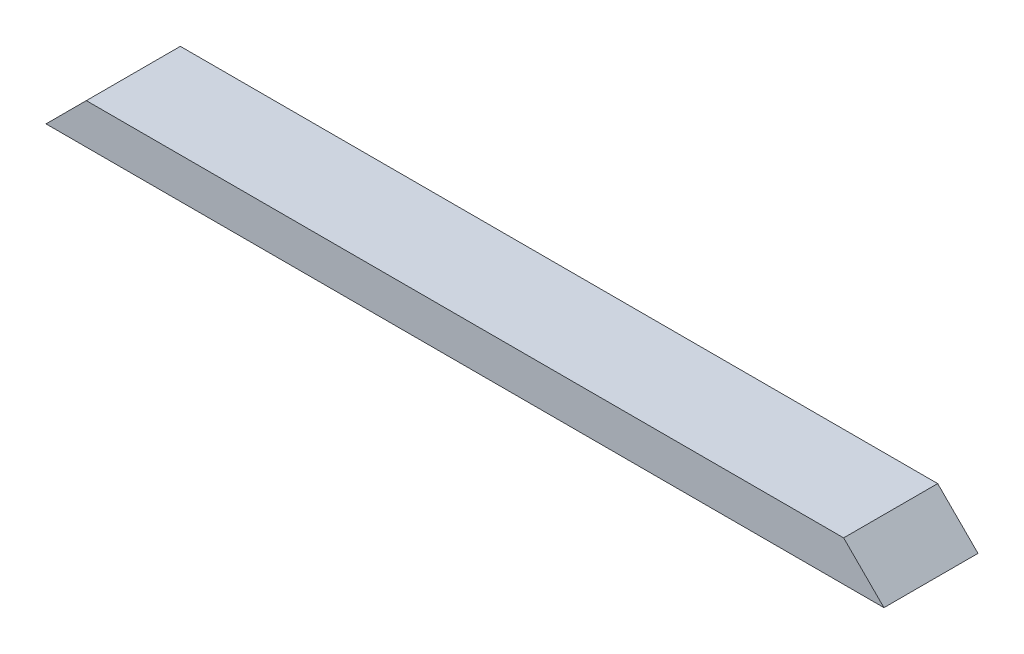
ISO-10303-21;
HEADER;
FILE_DESCRIPTION(('STEP AP214'),'2;1');
FILE_NAME('part.step','',(''),(''),'','','');
FILE_SCHEMA(('AUTOMOTIVE_DESIGN { 1 0 10303 214 1 1 1 1 }'));
ENDSEC;
DATA;
#1=APPLICATION_CONTEXT('core data for automotive mechanical design processes');
#2=APPLICATION_PROTOCOL_DEFINITION('international standard','automotive_design',2000,#1);
#3=PRODUCT_CONTEXT('',#1,'mechanical');
#4=PRODUCT('Part','Part','',(#3));
#5=PRODUCT_RELATED_PRODUCT_CATEGORY('part','',(#4));
#6=PRODUCT_DEFINITION_FORMATION('','',#4);
#7=PRODUCT_DEFINITION_CONTEXT('part definition',#1,'design');
#8=PRODUCT_DEFINITION('design','',#6,#7);
#9=PRODUCT_DEFINITION_SHAPE('','',#8);
#10=(LENGTH_UNIT() NAMED_UNIT(*) SI_UNIT(.MILLI.,.METRE.));
#11=(NAMED_UNIT(*) PLANE_ANGLE_UNIT() SI_UNIT($,.RADIAN.));
#12=(NAMED_UNIT(*) SI_UNIT($,.STERADIAN.) SOLID_ANGLE_UNIT());
#13=UNCERTAINTY_MEASURE_WITH_UNIT(LENGTH_MEASURE(1.E-05),#10,'distance_accuracy_value','');
#14=(GEOMETRIC_REPRESENTATION_CONTEXT(3) GLOBAL_UNCERTAINTY_ASSIGNED_CONTEXT((#13)) GLOBAL_UNIT_ASSIGNED_CONTEXT((#10,
#11,#12)) REPRESENTATION_CONTEXT('',''));
#15=CARTESIAN_POINT('',(0.,0.,0.));
#16=DIRECTION('',(0.,0.,1.));
#17=DIRECTION('',(1.,0.,0.));
#18=AXIS2_PLACEMENT_3D('',#15,#16,#17);
#19=CARTESIAN_POINT('',(0.,38.1,0.));
#20=DIRECTION('',(0.,0.,-1.));
#21=DIRECTION('',(-1.,0.,0.));
#22=AXIS2_PLACEMENT_3D('',#19,#20,#21);
#23=PLANE('',#22);
#24=DIRECTION('',(1.,0.,0.));
#25=VECTOR('',#24,1.);
#26=CARTESIAN_POINT('',(0.,38.1,0.));
#27=LINE('',#26,#25);
#28=CARTESIAN_POINT('',(38.1,38.1,0.));
#29=VERTEX_POINT('',#28);
#30=CARTESIAN_POINT('',(754.0752,38.1,0.));
#31=VERTEX_POINT('',#30);
#32=EDGE_CURVE('E47',#29,#31,#27,.T.);
#33=ORIENTED_EDGE('',*,*,#32,.F.);
#34=DIRECTION('',(0.707106781186547,0.707106781186547,0.));
#35=VECTOR('',#34,1.);
#36=CARTESIAN_POINT('',(0.,0.,0.));
#37=LINE('',#36,#35);
#38=CARTESIAN_POINT('',(0.,0.,0.));
#39=VERTEX_POINT('',#38);
#40=EDGE_CURVE('E82',#39,#29,#37,.T.);
#41=ORIENTED_EDGE('',*,*,#40,.F.);
#42=DIRECTION('',(1.,0.,0.));
#43=VECTOR('',#42,1.);
#44=CARTESIAN_POINT('',(0.,0.,0.));
#45=LINE('',#44,#43);
#46=CARTESIAN_POINT('',(792.1752,0.,0.));
#47=VERTEX_POINT('',#46);
#48=EDGE_CURVE('E87',#39,#47,#45,.T.);
#49=ORIENTED_EDGE('',*,*,#48,.T.);
#50=DIRECTION('',(0.707106781186548,-0.707106781186547,0.));
#51=VECTOR('',#50,1.);
#52=CARTESIAN_POINT('',(754.0752,38.1,0.));
#53=LINE('',#52,#51);
#54=EDGE_CURVE('E63',#31,#47,#53,.T.);
#55=ORIENTED_EDGE('',*,*,#54,.F.);
#56=EDGE_LOOP('',(#33,#41,#49,#55));
#57=FACE_BOUND('',#56,.T.);
#58=ADVANCED_FACE('F39',(#57),#23,.F.);
#59=CARTESIAN_POINT('',(0.,38.1,-88.9));
#60=DIRECTION('',(0.,0.,1.));
#61=DIRECTION('',(1.,0.,0.));
#62=AXIS2_PLACEMENT_3D('',#59,#60,#61);
#63=PLANE('',#62);
#64=DIRECTION('',(-1.,0.,0.));
#65=VECTOR('',#64,1.);
#66=CARTESIAN_POINT('',(0.,0.,-88.9));
#67=LINE('',#66,#65);
#68=CARTESIAN_POINT('',(792.1752,0.,-88.9));
#69=VERTEX_POINT('',#68);
#70=CARTESIAN_POINT('',(0.,0.,-88.9));
#71=VERTEX_POINT('',#70);
#72=EDGE_CURVE('E42',#69,#71,#67,.T.);
#73=ORIENTED_EDGE('',*,*,#72,.T.);
#74=DIRECTION('',(0.707106781186547,0.707106781186547,0.));
#75=VECTOR('',#74,1.);
#76=CARTESIAN_POINT('',(0.,0.,-88.9));
#77=LINE('',#76,#75);
#78=CARTESIAN_POINT('',(38.1,38.1,-88.9));
#79=VERTEX_POINT('',#78);
#80=EDGE_CURVE('E55',#71,#79,#77,.T.);
#81=ORIENTED_EDGE('',*,*,#80,.T.);
#82=DIRECTION('',(-1.,0.,0.));
#83=VECTOR('',#82,1.);
#84=CARTESIAN_POINT('',(0.,38.1,-88.9));
#85=LINE('',#84,#83);
#86=CARTESIAN_POINT('',(754.0752,38.1,-88.9));
#87=VERTEX_POINT('',#86);
#88=EDGE_CURVE('E11',#87,#79,#85,.T.);
#89=ORIENTED_EDGE('',*,*,#88,.F.);
#90=DIRECTION('',(0.707106781186548,-0.707106781186547,0.));
#91=VECTOR('',#90,1.);
#92=CARTESIAN_POINT('',(754.0752,38.1,-88.9));
#93=LINE('',#92,#91);
#94=EDGE_CURVE('E100',#87,#69,#93,.T.);
#95=ORIENTED_EDGE('',*,*,#94,.T.);
#96=EDGE_LOOP('',(#73,#81,#89,#95));
#97=FACE_BOUND('',#96,.T.);
#98=ADVANCED_FACE('F109',(#97),#63,.F.);
#99=CARTESIAN_POINT('',(0.,38.1,0.));
#100=DIRECTION('',(0.,-1.,0.));
#101=DIRECTION('',(0.,0.,-1.));
#102=AXIS2_PLACEMENT_3D('',#99,#100,#101);
#103=PLANE('',#102);
#104=ORIENTED_EDGE('',*,*,#88,.T.);
#105=DIRECTION('',(0.,0.,1.));
#106=VECTOR('',#105,1.);
#107=CARTESIAN_POINT('',(38.1,38.1,-88.9));
#108=LINE('',#107,#106);
#109=EDGE_CURVE('E88',#79,#29,#108,.T.);
#110=ORIENTED_EDGE('',*,*,#109,.T.);
#111=ORIENTED_EDGE('',*,*,#32,.T.);
#112=DIRECTION('',(0.,0.,1.));
#113=VECTOR('',#112,1.);
#114=CARTESIAN_POINT('',(754.0752,38.1,-88.9));
#115=LINE('',#114,#113);
#116=EDGE_CURVE('E103',#87,#31,#115,.T.);
#117=ORIENTED_EDGE('',*,*,#116,.F.);
#118=EDGE_LOOP('',(#104,#110,#111,#117));
#119=FACE_BOUND('',#118,.T.);
#120=ADVANCED_FACE('F112',(#119),#103,.F.);
#121=CARTESIAN_POINT('',(0.,0.,0.));
#122=DIRECTION('',(0.,-1.,0.));
#123=DIRECTION('',(0.,0.,-1.));
#124=AXIS2_PLACEMENT_3D('',#121,#122,#123);
#125=PLANE('',#124);
#126=DIRECTION('',(0.,0.,1.));
#127=VECTOR('',#126,1.);
#128=CARTESIAN_POINT('',(0.,0.,0.));
#129=LINE('',#128,#127);
#130=EDGE_CURVE('E79',#71,#39,#129,.T.);
#131=ORIENTED_EDGE('',*,*,#130,.F.);
#132=ORIENTED_EDGE('',*,*,#72,.F.);
#133=DIRECTION('',(0.,0.,-1.));
#134=VECTOR('',#133,1.);
#135=CARTESIAN_POINT('',(792.1752,0.,0.));
#136=LINE('',#135,#134);
#137=EDGE_CURVE('E96',#47,#69,#136,.T.);
#138=ORIENTED_EDGE('',*,*,#137,.F.);
#139=ORIENTED_EDGE('',*,*,#48,.F.);
#140=EDGE_LOOP('',(#131,#132,#138,#139));
#141=FACE_BOUND('',#140,.T.);
#142=ADVANCED_FACE('F95',(#141),#125,.T.);
#143=CARTESIAN_POINT('',(754.0752,38.1,-88.9));
#144=DIRECTION('',(-0.707106781186547,-0.707106781186548,0.));
#145=DIRECTION('',(0.707106781186548,-0.707106781186547,0.));
#146=AXIS2_PLACEMENT_3D('',#143,#144,#145);
#147=PLANE('',#146);
#148=ORIENTED_EDGE('',*,*,#54,.T.);
#149=ORIENTED_EDGE('',*,*,#137,.T.);
#150=ORIENTED_EDGE('',*,*,#94,.F.);
#151=ORIENTED_EDGE('',*,*,#116,.T.);
#152=EDGE_LOOP('',(#148,#149,#150,#151));
#153=FACE_BOUND('',#152,.T.);
#154=ADVANCED_FACE('F113',(#153),#147,.F.);
#155=CARTESIAN_POINT('',(0.,0.,-88.9));
#156=DIRECTION('',(0.707106781186547,-0.707106781186547,0.));
#157=DIRECTION('',(0.707106781186548,0.707106781186548,0.));
#158=AXIS2_PLACEMENT_3D('',#155,#156,#157);
#159=PLANE('',#158);
#160=ORIENTED_EDGE('',*,*,#40,.T.);
#161=ORIENTED_EDGE('',*,*,#109,.F.);
#162=ORIENTED_EDGE('',*,*,#80,.F.);
#163=ORIENTED_EDGE('',*,*,#130,.T.);
#164=EDGE_LOOP('',(#160,#161,#162,#163));
#165=FACE_BOUND('',#164,.T.);
#166=ADVANCED_FACE('F81',(#165),#159,.F.);
#167=CLOSED_SHELL('',(#58,#98,#120,#142,#154,#166));
#168=MANIFOLD_SOLID_BREP('B2',#167);
#169=ADVANCED_BREP_SHAPE_REPRESENTATION('',(#18,#168),#14);
#170=SHAPE_DEFINITION_REPRESENTATION(#9,#169);
ENDSEC;
END-ISO-10303-21;
